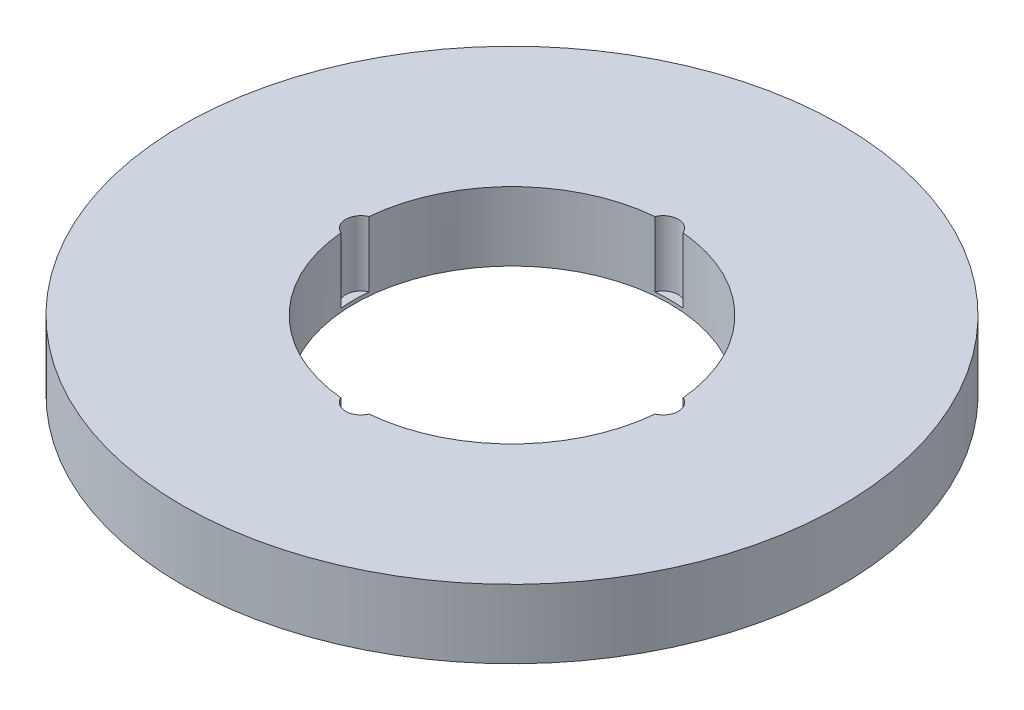
ISO-10303-21;
HEADER;
FILE_DESCRIPTION(('STEP AP214'),'2;1');
FILE_NAME('part.step','',(''),(''),'','','');
FILE_SCHEMA(('AUTOMOTIVE_DESIGN { 1 0 10303 214 1 1 1 1 }'));
ENDSEC;
DATA;
#1=APPLICATION_CONTEXT('core data for automotive mechanical design processes');
#2=APPLICATION_PROTOCOL_DEFINITION('international standard','automotive_design',2000,#1);
#3=PRODUCT_CONTEXT('',#1,'mechanical');
#4=PRODUCT('Part','Part','',(#3));
#5=PRODUCT_RELATED_PRODUCT_CATEGORY('part','',(#4));
#6=PRODUCT_DEFINITION_FORMATION('','',#4);
#7=PRODUCT_DEFINITION_CONTEXT('part definition',#1,'design');
#8=PRODUCT_DEFINITION('design','',#6,#7);
#9=PRODUCT_DEFINITION_SHAPE('','',#8);
#10=(LENGTH_UNIT() NAMED_UNIT(*) SI_UNIT(.MILLI.,.METRE.));
#11=(NAMED_UNIT(*) PLANE_ANGLE_UNIT() SI_UNIT($,.RADIAN.));
#12=(NAMED_UNIT(*) SI_UNIT($,.STERADIAN.) SOLID_ANGLE_UNIT());
#13=UNCERTAINTY_MEASURE_WITH_UNIT(LENGTH_MEASURE(1.E-05),#10,'distance_accuracy_value','');
#14=(GEOMETRIC_REPRESENTATION_CONTEXT(3) GLOBAL_UNCERTAINTY_ASSIGNED_CONTEXT((#13)) GLOBAL_UNIT_ASSIGNED_CONTEXT((#10,
#11,#12)) REPRESENTATION_CONTEXT('',''));
#15=CARTESIAN_POINT('',(0.,0.,0.));
#16=DIRECTION('',(0.,0.,1.));
#17=DIRECTION('',(1.,0.,0.));
#18=AXIS2_PLACEMENT_3D('',#15,#16,#17);
#19=CARTESIAN_POINT('',(0.,12.,0.));
#20=DIRECTION('',(0.,-1.,0.));
#21=DIRECTION('',(0.,0.,-1.));
#22=AXIS2_PLACEMENT_3D('',#19,#20,#21);
#23=CYLINDRICAL_SURFACE('',#22,57.5);
#24=CARTESIAN_POINT('',(0.,12.,0.));
#25=DIRECTION('',(0.,1.,0.));
#26=DIRECTION('',(0.,0.,1.));
#27=AXIS2_PLACEMENT_3D('',#24,#25,#26);
#28=CIRCLE('',#27,57.5);
#29=CARTESIAN_POINT('',(0.,12.,57.5));
#30=VERTEX_POINT('',#29);
#31=EDGE_CURVE('E148',#30,#30,#28,.T.);
#32=ORIENTED_EDGE('',*,*,#31,.F.);
#33=EDGE_LOOP('',(#32));
#34=FACE_BOUND('',#33,.T.);
#35=CARTESIAN_POINT('',(0.,0.,0.));
#36=DIRECTION('',(0.,1.,0.));
#37=DIRECTION('',(0.,0.,1.));
#38=AXIS2_PLACEMENT_3D('',#35,#36,#37);
#39=CIRCLE('',#38,57.5);
#40=CARTESIAN_POINT('',(0.,0.,57.5));
#41=VERTEX_POINT('',#40);
#42=EDGE_CURVE('E139',#41,#41,#39,.T.);
#43=ORIENTED_EDGE('',*,*,#42,.T.);
#44=EDGE_LOOP('',(#43));
#45=FACE_BOUND('',#44,.T.);
#46=ADVANCED_FACE('F39',(#34,#45),#23,.T.);
#47=CARTESIAN_POINT('',(0.,12.,0.));
#48=DIRECTION('',(0.,1.,0.));
#49=DIRECTION('',(0.,0.,1.));
#50=AXIS2_PLACEMENT_3D('',#47,#48,#49);
#51=PLANE('',#50);
#52=CARTESIAN_POINT('',(0.,12.,26.3614122490976));
#53=DIRECTION('',(0.,1.,0.));
#54=DIRECTION('',(1.,0.,0.));
#55=AXIS2_PLACEMENT_3D('',#52,#53,#54);
#56=CIRCLE('',#55,2.65647045423864);
#57=CARTESIAN_POINT('',(-2.44894221903901,12.,27.3907408079411));
#58=VERTEX_POINT('',#57);
#59=CARTESIAN_POINT('',(2.4489422190392,12.,27.3907408079411));
#60=VERTEX_POINT('',#59);
#61=EDGE_CURVE('E175',#58,#60,#56,.T.);
#62=ORIENTED_EDGE('',*,*,#61,.F.);
#63=CARTESIAN_POINT('',(0.,12.,0.));
#64=DIRECTION('',(0.,1.,0.));
#65=DIRECTION('',(0.,0.,1.));
#66=AXIS2_PLACEMENT_3D('',#63,#64,#65);
#67=CIRCLE('',#66,27.5);
#68=CARTESIAN_POINT('',(-27.3907408079411,12.,2.4489422190391));
#69=VERTEX_POINT('',#68);
#70=EDGE_CURVE('E134',#69,#58,#67,.T.);
#71=ORIENTED_EDGE('',*,*,#70,.F.);
#72=CARTESIAN_POINT('',(-26.3614122490976,12.,0.));
#73=DIRECTION('',(0.,1.,0.));
#74=DIRECTION('',(0.,0.,1.));
#75=AXIS2_PLACEMENT_3D('',#72,#73,#74);
#76=CIRCLE('',#75,2.65647045423864);
#77=CARTESIAN_POINT('',(-27.3907408079411,12.,-2.4489422190391));
#78=VERTEX_POINT('',#77);
#79=EDGE_CURVE('E143',#78,#69,#76,.T.);
#80=ORIENTED_EDGE('',*,*,#79,.F.);
#81=CARTESIAN_POINT('',(-2.44894221903939,12.,-27.390740807941));
#82=VERTEX_POINT('',#81);
#83=EDGE_CURVE('E123',#82,#78,#67,.T.);
#84=ORIENTED_EDGE('',*,*,#83,.F.);
#85=CARTESIAN_POINT('',(-2.76121136799825E-13,12.,-26.3614122490976));
#86=DIRECTION('',(0.,1.,0.));
#87=DIRECTION('',(-1.,0.,0.));
#88=AXIS2_PLACEMENT_3D('',#85,#86,#87);
#89=CIRCLE('',#88,2.65647045423864);
#90=CARTESIAN_POINT('',(2.44894221903882,12.,-27.3907408079411));
#91=VERTEX_POINT('',#90);
#92=EDGE_CURVE('E106',#91,#82,#89,.T.);
#93=ORIENTED_EDGE('',*,*,#92,.F.);
#94=CARTESIAN_POINT('',(27.3907408079411,12.,-2.4489422190391));
#95=VERTEX_POINT('',#94);
#96=EDGE_CURVE('E125',#95,#91,#67,.T.);
#97=ORIENTED_EDGE('',*,*,#96,.F.);
#98=CARTESIAN_POINT('',(26.3614122490976,12.,0.));
#99=DIRECTION('',(0.,1.,0.));
#100=DIRECTION('',(0.,0.,-1.));
#101=AXIS2_PLACEMENT_3D('',#98,#99,#100);
#102=CIRCLE('',#101,2.65647045423864);
#103=CARTESIAN_POINT('',(27.3907408079411,12.,2.4489422190391));
#104=VERTEX_POINT('',#103);
#105=EDGE_CURVE('E286',#104,#95,#102,.T.);
#106=ORIENTED_EDGE('',*,*,#105,.F.);
#107=EDGE_CURVE('E135',#60,#104,#67,.T.);
#108=ORIENTED_EDGE('',*,*,#107,.F.);
#109=EDGE_LOOP('',(#62,#71,#80,#84,#93,#97,#106,#108));
#110=FACE_BOUND('',#109,.T.);
#111=ORIENTED_EDGE('',*,*,#31,.T.);
#112=EDGE_LOOP('',(#111));
#113=FACE_BOUND('',#112,.T.);
#114=ADVANCED_FACE('F118',(#110,#113),#51,.T.);
#115=CARTESIAN_POINT('',(0.,0.,0.));
#116=DIRECTION('',(0.,1.,0.));
#117=DIRECTION('',(0.,0.,1.));
#118=AXIS2_PLACEMENT_3D('',#115,#116,#117);
#119=PLANE('',#118);
#120=CARTESIAN_POINT('',(0.,0.,0.));
#121=DIRECTION('',(0.,1.,0.));
#122=DIRECTION('',(0.,0.,1.));
#123=AXIS2_PLACEMENT_3D('',#120,#121,#122);
#124=CIRCLE('',#123,27.5);
#125=CARTESIAN_POINT('',(0.,0.,27.5));
#126=VERTEX_POINT('',#125);
#127=EDGE_CURVE('E136',#126,#126,#124,.T.);
#128=ORIENTED_EDGE('',*,*,#127,.T.);
#129=EDGE_LOOP('',(#128));
#130=FACE_BOUND('',#129,.T.);
#131=ORIENTED_EDGE('',*,*,#42,.F.);
#132=EDGE_LOOP('',(#131));
#133=FACE_BOUND('',#132,.T.);
#134=ADVANCED_FACE('F187',(#130,#133),#119,.F.);
#135=CARTESIAN_POINT('',(0.,12.,0.));
#136=DIRECTION('',(0.,-1.,0.));
#137=DIRECTION('',(0.,0.,-1.));
#138=AXIS2_PLACEMENT_3D('',#135,#136,#137);
#139=CYLINDRICAL_SURFACE('',#138,27.5);
#140=DIRECTION('',(0.,1.,0.));
#141=VECTOR('',#140,1.);
#142=CARTESIAN_POINT('',(-2.448942219039,6.30572362208951,27.3907408079411));
#143=LINE('',#142,#141);
#144=CARTESIAN_POINT('',(-2.44894221903901,0.611447244179011,27.3907408079411));
#145=VERTEX_POINT('',#144);
#146=EDGE_CURVE('E11',#145,#58,#143,.T.);
#147=ORIENTED_EDGE('',*,*,#146,.F.);
#148=CARTESIAN_POINT('',(0.,0.611447244179011,0.));
#149=DIRECTION('',(0.,1.,0.));
#150=DIRECTION('',(0.,0.,1.));
#151=AXIS2_PLACEMENT_3D('',#148,#149,#150);
#152=CIRCLE('',#151,27.5);
#153=CARTESIAN_POINT('',(2.4489422190392,0.611447244179011,27.3907408079411));
#154=VERTEX_POINT('',#153);
#155=EDGE_CURVE('E170',#145,#154,#152,.T.);
#156=ORIENTED_EDGE('',*,*,#155,.T.);
#157=DIRECTION('',(0.,1.,0.));
#158=VECTOR('',#157,1.);
#159=CARTESIAN_POINT('',(2.44894221903919,6.30572362208951,27.3907408079411));
#160=LINE('',#159,#158);
#161=EDGE_CURVE('E46',#60,#154,#160,.F.);
#162=ORIENTED_EDGE('',*,*,#161,.F.);
#163=ORIENTED_EDGE('',*,*,#107,.T.);
#164=DIRECTION('',(0.,1.,0.));
#165=VECTOR('',#164,1.);
#166=CARTESIAN_POINT('',(27.3907408079411,6.30572362208951,2.4489422190391));
#167=LINE('',#166,#165);
#168=CARTESIAN_POINT('',(27.3907408079411,0.611447244179011,2.4489422190391));
#169=VERTEX_POINT('',#168);
#170=EDGE_CURVE('E164',#169,#104,#167,.T.);
#171=ORIENTED_EDGE('',*,*,#170,.F.);
#172=CARTESIAN_POINT('',(0.,0.611447244179011,0.));
#173=DIRECTION('',(0.,1.,0.));
#174=DIRECTION('',(0.,0.,1.));
#175=AXIS2_PLACEMENT_3D('',#172,#173,#174);
#176=CIRCLE('',#175,27.5);
#177=CARTESIAN_POINT('',(27.3907408079411,0.611447244179011,-2.4489422190391));
#178=VERTEX_POINT('',#177);
#179=EDGE_CURVE('E115',#169,#178,#176,.T.);
#180=ORIENTED_EDGE('',*,*,#179,.T.);
#181=DIRECTION('',(0.,1.,0.));
#182=VECTOR('',#181,1.);
#183=CARTESIAN_POINT('',(27.3907408079411,6.30572362208951,-2.4489422190391));
#184=LINE('',#183,#182);
#185=EDGE_CURVE('E131',#95,#178,#184,.F.);
#186=ORIENTED_EDGE('',*,*,#185,.F.);
#187=ORIENTED_EDGE('',*,*,#96,.T.);
#188=DIRECTION('',(0.,1.,0.));
#189=VECTOR('',#188,1.);
#190=CARTESIAN_POINT('',(2.44894221903881,6.30572362208951,-27.3907408079411));
#191=LINE('',#190,#189);
#192=CARTESIAN_POINT('',(2.44894221903882,0.611447244179011,-27.3907408079411));
#193=VERTEX_POINT('',#192);
#194=EDGE_CURVE('E105',#193,#91,#191,.T.);
#195=ORIENTED_EDGE('',*,*,#194,.F.);
#196=CARTESIAN_POINT('',(0.,0.611447244179011,0.));
#197=DIRECTION('',(0.,1.,0.));
#198=DIRECTION('',(0.,0.,1.));
#199=AXIS2_PLACEMENT_3D('',#196,#197,#198);
#200=CIRCLE('',#199,27.5);
#201=CARTESIAN_POINT('',(-2.44894221903939,0.611447244179011,-27.390740807941));
#202=VERTEX_POINT('',#201);
#203=EDGE_CURVE('E159',#193,#202,#200,.T.);
#204=ORIENTED_EDGE('',*,*,#203,.T.);
#205=DIRECTION('',(0.,1.,0.));
#206=VECTOR('',#205,1.);
#207=CARTESIAN_POINT('',(-2.44894221903938,6.30572362208951,-27.3907408079411));
#208=LINE('',#207,#206);
#209=EDGE_CURVE('E114',#82,#202,#208,.F.);
#210=ORIENTED_EDGE('',*,*,#209,.F.);
#211=ORIENTED_EDGE('',*,*,#83,.T.);
#212=DIRECTION('',(0.,1.,0.));
#213=VECTOR('',#212,1.);
#214=CARTESIAN_POINT('',(-27.3907408079411,6.30572362208951,-2.4489422190391));
#215=LINE('',#214,#213);
#216=CARTESIAN_POINT('',(-27.3907408079411,0.611447244179011,-2.4489422190391));
#217=VERTEX_POINT('',#216);
#218=EDGE_CURVE('E160',#217,#78,#215,.T.);
#219=ORIENTED_EDGE('',*,*,#218,.F.);
#220=CARTESIAN_POINT('',(0.,0.611447244179011,0.));
#221=DIRECTION('',(0.,1.,0.));
#222=DIRECTION('',(0.,0.,1.));
#223=AXIS2_PLACEMENT_3D('',#220,#221,#222);
#224=CIRCLE('',#223,27.5);
#225=CARTESIAN_POINT('',(-27.3907408079411,0.611447244179011,2.4489422190391));
#226=VERTEX_POINT('',#225);
#227=EDGE_CURVE('E149',#217,#226,#224,.T.);
#228=ORIENTED_EDGE('',*,*,#227,.T.);
#229=DIRECTION('',(0.,1.,0.));
#230=VECTOR('',#229,1.);
#231=CARTESIAN_POINT('',(-27.3907408079411,6.30572362208951,2.4489422190391));
#232=LINE('',#231,#230);
#233=EDGE_CURVE('E152',#69,#226,#232,.F.);
#234=ORIENTED_EDGE('',*,*,#233,.F.);
#235=ORIENTED_EDGE('',*,*,#70,.T.);
#236=EDGE_LOOP('',(#147,#156,#162,#163,#171,#180,#186,#187,#195,#204,#210,#211,#219,#228,#234,#235));
#237=FACE_BOUND('',#236,.T.);
#238=ORIENTED_EDGE('',*,*,#127,.F.);
#239=EDGE_LOOP('',(#238));
#240=FACE_BOUND('',#239,.T.);
#241=ADVANCED_FACE('F126',(#237,#240),#139,.F.);
#242=CARTESIAN_POINT('',(-26.3614122490976,0.611447244179011,0.));
#243=DIRECTION('',(0.,1.,0.));
#244=DIRECTION('',(0.,0.,1.));
#245=AXIS2_PLACEMENT_3D('',#242,#243,#244);
#246=CYLINDRICAL_SURFACE('',#245,2.65647045423864);
#247=ORIENTED_EDGE('',*,*,#218,.T.);
#248=ORIENTED_EDGE('',*,*,#79,.T.);
#249=ORIENTED_EDGE('',*,*,#233,.T.);
#250=CARTESIAN_POINT('',(-26.3614122490976,0.611447244179011,0.));
#251=DIRECTION('',(0.,1.,0.));
#252=DIRECTION('',(0.,0.,1.));
#253=AXIS2_PLACEMENT_3D('',#250,#251,#252);
#254=CIRCLE('',#253,2.65647045423864);
#255=EDGE_CURVE('E144',#217,#226,#254,.T.);
#256=ORIENTED_EDGE('',*,*,#255,.F.);
#257=EDGE_LOOP('',(#247,#248,#249,#256));
#258=FACE_BOUND('',#257,.T.);
#259=ADVANCED_FACE('F200',(#258),#246,.F.);
#260=CARTESIAN_POINT('',(-26.3614122490976,0.611447244179011,0.));
#261=DIRECTION('',(0.,1.,0.));
#262=DIRECTION('',(0.,0.,1.));
#263=AXIS2_PLACEMENT_3D('',#260,#261,#262);
#264=PLANE('',#263);
#265=ORIENTED_EDGE('',*,*,#255,.T.);
#266=ORIENTED_EDGE('',*,*,#227,.F.);
#267=EDGE_LOOP('',(#265,#266));
#268=FACE_BOUND('',#267,.T.);
#269=ADVANCED_FACE('F201',(#268),#264,.T.);
#270=CARTESIAN_POINT('',(-2.76121136799825E-13,0.611447244179011,-26.3614122490976));
#271=DIRECTION('',(0.,1.,0.));
#272=DIRECTION('',(0.,0.,1.));
#273=AXIS2_PLACEMENT_3D('',#270,#271,#272);
#274=CYLINDRICAL_SURFACE('',#273,2.65647045423864);
#275=ORIENTED_EDGE('',*,*,#194,.T.);
#276=ORIENTED_EDGE('',*,*,#92,.T.);
#277=ORIENTED_EDGE('',*,*,#209,.T.);
#278=CARTESIAN_POINT('',(-2.76121136799825E-13,0.611447244179011,-26.3614122490976));
#279=DIRECTION('',(0.,1.,0.));
#280=DIRECTION('',(-1.,0.,0.));
#281=AXIS2_PLACEMENT_3D('',#278,#279,#280);
#282=CIRCLE('',#281,2.65647045423864);
#283=EDGE_CURVE('E107',#193,#202,#282,.T.);
#284=ORIENTED_EDGE('',*,*,#283,.F.);
#285=EDGE_LOOP('',(#275,#276,#277,#284));
#286=FACE_BOUND('',#285,.T.);
#287=ADVANCED_FACE('F102',(#286),#274,.F.);
#288=CARTESIAN_POINT('',(-2.76121136799825E-13,0.611447244179011,-26.3614122490976));
#289=DIRECTION('',(0.,1.,0.));
#290=DIRECTION('',(-1.,0.,0.));
#291=AXIS2_PLACEMENT_3D('',#288,#289,#290);
#292=PLANE('',#291);
#293=ORIENTED_EDGE('',*,*,#283,.T.);
#294=ORIENTED_EDGE('',*,*,#203,.F.);
#295=EDGE_LOOP('',(#293,#294));
#296=FACE_BOUND('',#295,.T.);
#297=ADVANCED_FACE('F209',(#296),#292,.T.);
#298=CARTESIAN_POINT('',(26.3614122490976,0.611447244179011,0.));
#299=DIRECTION('',(0.,1.,0.));
#300=DIRECTION('',(0.,0.,1.));
#301=AXIS2_PLACEMENT_3D('',#298,#299,#300);
#302=CYLINDRICAL_SURFACE('',#301,2.65647045423864);
#303=ORIENTED_EDGE('',*,*,#170,.T.);
#304=ORIENTED_EDGE('',*,*,#105,.T.);
#305=ORIENTED_EDGE('',*,*,#185,.T.);
#306=CARTESIAN_POINT('',(26.3614122490976,0.611447244179011,0.));
#307=DIRECTION('',(0.,1.,0.));
#308=DIRECTION('',(0.,0.,-1.));
#309=AXIS2_PLACEMENT_3D('',#306,#307,#308);
#310=CIRCLE('',#309,2.65647045423864);
#311=EDGE_CURVE('E56',#169,#178,#310,.T.);
#312=ORIENTED_EDGE('',*,*,#311,.F.);
#313=EDGE_LOOP('',(#303,#304,#305,#312));
#314=FACE_BOUND('',#313,.T.);
#315=ADVANCED_FACE('F213',(#314),#302,.F.);
#316=CARTESIAN_POINT('',(26.3614122490976,0.611447244179011,0.));
#317=DIRECTION('',(0.,1.,0.));
#318=DIRECTION('',(0.,0.,-1.));
#319=AXIS2_PLACEMENT_3D('',#316,#317,#318);
#320=PLANE('',#319);
#321=ORIENTED_EDGE('',*,*,#311,.T.);
#322=ORIENTED_EDGE('',*,*,#179,.F.);
#323=EDGE_LOOP('',(#321,#322));
#324=FACE_BOUND('',#323,.T.);
#325=ADVANCED_FACE('F179',(#324),#320,.T.);
#326=CARTESIAN_POINT('',(0.,0.611447244179011,26.3614122490976));
#327=DIRECTION('',(0.,1.,0.));
#328=DIRECTION('',(0.,0.,1.));
#329=AXIS2_PLACEMENT_3D('',#326,#327,#328);
#330=CYLINDRICAL_SURFACE('',#329,2.65647045423864);
#331=ORIENTED_EDGE('',*,*,#146,.T.);
#332=ORIENTED_EDGE('',*,*,#61,.T.);
#333=ORIENTED_EDGE('',*,*,#161,.T.);
#334=CARTESIAN_POINT('',(0.,0.611447244179011,26.3614122490976));
#335=DIRECTION('',(0.,1.,0.));
#336=DIRECTION('',(1.,0.,0.));
#337=AXIS2_PLACEMENT_3D('',#334,#335,#336);
#338=CIRCLE('',#337,2.65647045423864);
#339=EDGE_CURVE('E55',#145,#154,#338,.T.);
#340=ORIENTED_EDGE('',*,*,#339,.F.);
#341=EDGE_LOOP('',(#331,#332,#333,#340));
#342=FACE_BOUND('',#341,.T.);
#343=ADVANCED_FACE('F171',(#342),#330,.F.);
#344=CARTESIAN_POINT('',(0.,0.611447244179011,26.3614122490976));
#345=DIRECTION('',(0.,1.,0.));
#346=DIRECTION('',(1.,0.,0.));
#347=AXIS2_PLACEMENT_3D('',#344,#345,#346);
#348=PLANE('',#347);
#349=ORIENTED_EDGE('',*,*,#339,.T.);
#350=ORIENTED_EDGE('',*,*,#155,.F.);
#351=EDGE_LOOP('',(#349,#350));
#352=FACE_BOUND('',#351,.T.);
#353=ADVANCED_FACE('F173',(#352),#348,.T.);
#354=CLOSED_SHELL('',(#46,#114,#134,#241,#259,#269,#287,#297,#315,#325,#343,#353));
#355=MANIFOLD_SOLID_BREP('B2',#354);
#356=ADVANCED_BREP_SHAPE_REPRESENTATION('',(#18,#355),#14);
#357=SHAPE_DEFINITION_REPRESENTATION(#9,#356);
ENDSEC;
END-ISO-10303-21;
